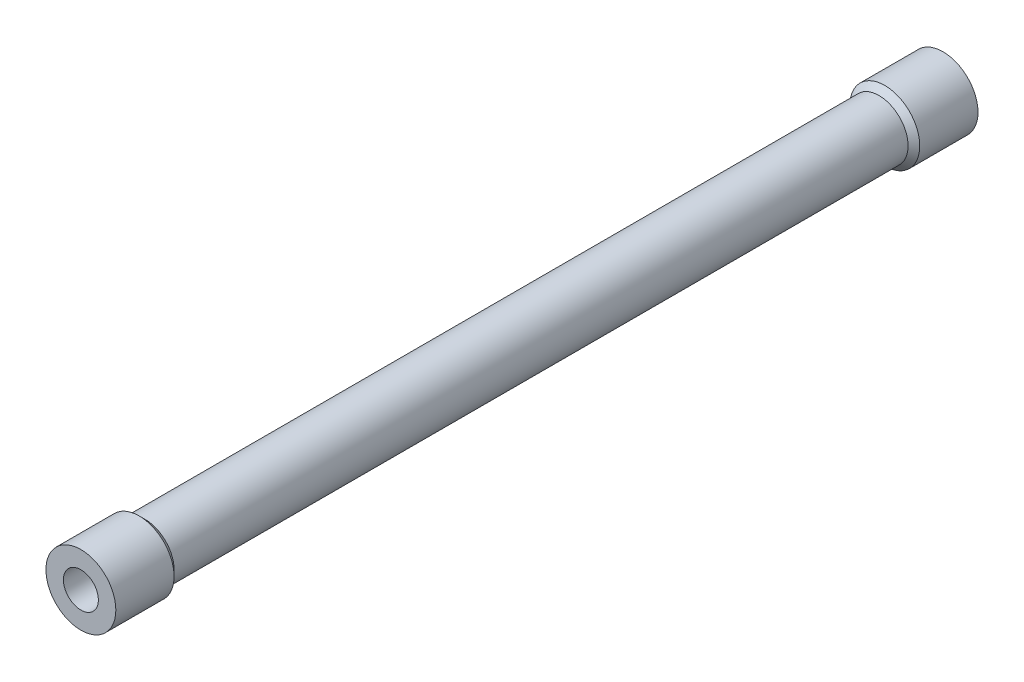
ISO-10303-21;
HEADER;
FILE_DESCRIPTION(('STEP AP214'),'2;1');
FILE_NAME('part.step','',(''),(''),'','','');
FILE_SCHEMA(('AUTOMOTIVE_DESIGN { 1 0 10303 214 1 1 1 1 }'));
ENDSEC;
DATA;
#1=APPLICATION_CONTEXT('core data for automotive mechanical design processes');
#2=APPLICATION_PROTOCOL_DEFINITION('international standard','automotive_design',2000,#1);
#3=PRODUCT_CONTEXT('',#1,'mechanical');
#4=PRODUCT('Part','Part','',(#3));
#5=PRODUCT_RELATED_PRODUCT_CATEGORY('part','',(#4));
#6=PRODUCT_DEFINITION_FORMATION('','',#4);
#7=PRODUCT_DEFINITION_CONTEXT('part definition',#1,'design');
#8=PRODUCT_DEFINITION('design','',#6,#7);
#9=PRODUCT_DEFINITION_SHAPE('','',#8);
#10=(LENGTH_UNIT() NAMED_UNIT(*) SI_UNIT(.MILLI.,.METRE.));
#11=(NAMED_UNIT(*) PLANE_ANGLE_UNIT() SI_UNIT($,.RADIAN.));
#12=(NAMED_UNIT(*) SI_UNIT($,.STERADIAN.) SOLID_ANGLE_UNIT());
#13=UNCERTAINTY_MEASURE_WITH_UNIT(LENGTH_MEASURE(1.E-05),#10,'distance_accuracy_value','');
#14=(GEOMETRIC_REPRESENTATION_CONTEXT(3) GLOBAL_UNCERTAINTY_ASSIGNED_CONTEXT((#13)) GLOBAL_UNIT_ASSIGNED_CONTEXT((#10,
#11,#12)) REPRESENTATION_CONTEXT('',''));
#15=CARTESIAN_POINT('',(0.,0.,0.));
#16=DIRECTION('',(0.,0.,1.));
#17=DIRECTION('',(1.,0.,0.));
#18=AXIS2_PLACEMENT_3D('',#15,#16,#17);
#19=CARTESIAN_POINT('',(0.,0.,74.));
#20=DIRECTION('',(0.,0.,-1.));
#21=DIRECTION('',(-1.,0.,0.));
#22=AXIS2_PLACEMENT_3D('',#19,#20,#21);
#23=CYLINDRICAL_SURFACE('',#22,2.5);
#24=CARTESIAN_POINT('',(0.,0.,5.49999999999999));
#25=DIRECTION('',(0.,0.,-1.));
#26=DIRECTION('',(-1.,0.,0.));
#27=AXIS2_PLACEMENT_3D('',#24,#25,#26);
#28=CIRCLE('',#27,2.5);
#29=CARTESIAN_POINT('',(-2.5,0.,5.49999999999999));
#30=VERTEX_POINT('',#29);
#31=EDGE_CURVE('E10',#30,#30,#28,.F.);
#32=ORIENTED_EDGE('',*,*,#31,.T.);
#33=EDGE_LOOP('',(#32));
#34=FACE_BOUND('',#33,.T.);
#35=CARTESIAN_POINT('',(0.,0.,68.5));
#36=DIRECTION('',(0.,0.,1.));
#37=DIRECTION('',(1.,0.,0.));
#38=AXIS2_PLACEMENT_3D('',#35,#36,#37);
#39=CIRCLE('',#38,2.5);
#40=CARTESIAN_POINT('',(2.5,0.,68.5));
#41=VERTEX_POINT('',#40);
#42=EDGE_CURVE('E41',#41,#41,#39,.F.);
#43=ORIENTED_EDGE('',*,*,#42,.T.);
#44=EDGE_LOOP('',(#43));
#45=FACE_BOUND('',#44,.T.);
#46=ADVANCED_FACE('F30',(#34,#45),#23,.T.);
#47=CARTESIAN_POINT('',(0.,0.,74.));
#48=DIRECTION('',(0.,0.,1.));
#49=DIRECTION('',(1.,0.,0.));
#50=AXIS2_PLACEMENT_3D('',#47,#48,#49);
#51=PLANE('',#50);
#52=CARTESIAN_POINT('',(0.,0.,74.));
#53=DIRECTION('',(0.,0.,1.));
#54=DIRECTION('',(1.,0.,0.));
#55=AXIS2_PLACEMENT_3D('',#52,#53,#54);
#56=CIRCLE('',#55,1.5);
#57=CARTESIAN_POINT('',(1.5,0.,74.));
#58=VERTEX_POINT('',#57);
#59=EDGE_CURVE('E50',#58,#58,#56,.T.);
#60=ORIENTED_EDGE('',*,*,#59,.F.);
#61=EDGE_LOOP('',(#60));
#62=FACE_BOUND('',#61,.T.);
#63=CARTESIAN_POINT('',(0.,0.,74.));
#64=DIRECTION('',(0.,0.,1.));
#65=DIRECTION('',(1.,0.,0.));
#66=AXIS2_PLACEMENT_3D('',#63,#64,#65);
#67=CIRCLE('',#66,3.);
#68=CARTESIAN_POINT('',(3.,0.,74.));
#69=VERTEX_POINT('',#68);
#70=EDGE_CURVE('E54',#69,#69,#67,.T.);
#71=ORIENTED_EDGE('',*,*,#70,.T.);
#72=EDGE_LOOP('',(#71));
#73=FACE_BOUND('',#72,.T.);
#74=ADVANCED_FACE('F68',(#62,#73),#51,.T.);
#75=CARTESIAN_POINT('',(0.,0.,0.));
#76=DIRECTION('',(0.,0.,1.));
#77=DIRECTION('',(1.,0.,0.));
#78=AXIS2_PLACEMENT_3D('',#75,#76,#77);
#79=PLANE('',#78);
#80=CARTESIAN_POINT('',(0.,0.,0.));
#81=DIRECTION('',(0.,0.,1.));
#82=DIRECTION('',(1.,0.,0.));
#83=AXIS2_PLACEMENT_3D('',#80,#81,#82);
#84=CIRCLE('',#83,1.5);
#85=CARTESIAN_POINT('',(1.5,0.,0.));
#86=VERTEX_POINT('',#85);
#87=EDGE_CURVE('E51',#86,#86,#84,.T.);
#88=ORIENTED_EDGE('',*,*,#87,.T.);
#89=EDGE_LOOP('',(#88));
#90=FACE_BOUND('',#89,.T.);
#91=CARTESIAN_POINT('',(0.,0.,0.));
#92=DIRECTION('',(0.,0.,1.));
#93=DIRECTION('',(1.,0.,0.));
#94=AXIS2_PLACEMENT_3D('',#91,#92,#93);
#95=CIRCLE('',#94,3.);
#96=CARTESIAN_POINT('',(3.,0.,0.));
#97=VERTEX_POINT('',#96);
#98=EDGE_CURVE('E59',#97,#97,#95,.T.);
#99=ORIENTED_EDGE('',*,*,#98,.F.);
#100=EDGE_LOOP('',(#99));
#101=FACE_BOUND('',#100,.T.);
#102=ADVANCED_FACE('F65',(#90,#101),#79,.F.);
#103=CARTESIAN_POINT('',(0.,0.,74.));
#104=DIRECTION('',(0.,0.,-1.));
#105=DIRECTION('',(-1.,0.,0.));
#106=AXIS2_PLACEMENT_3D('',#103,#104,#105);
#107=CYLINDRICAL_SURFACE('',#106,1.5);
#108=ORIENTED_EDGE('',*,*,#87,.F.);
#109=EDGE_LOOP('',(#108));
#110=FACE_BOUND('',#109,.T.);
#111=ORIENTED_EDGE('',*,*,#59,.T.);
#112=EDGE_LOOP('',(#111));
#113=FACE_BOUND('',#112,.T.);
#114=ADVANCED_FACE('F67',(#110,#113),#107,.F.);
#115=CARTESIAN_POINT('',(0.,0.,68.));
#116=DIRECTION('',(0.,0.,1.));
#117=DIRECTION('',(1.,0.,0.));
#118=AXIS2_PLACEMENT_3D('',#115,#116,#117);
#119=CYLINDRICAL_SURFACE('',#118,3.);
#120=CARTESIAN_POINT('',(0.,0.,69.));
#121=DIRECTION('',(0.,0.,1.));
#122=DIRECTION('',(1.,0.,0.));
#123=AXIS2_PLACEMENT_3D('',#120,#121,#122);
#124=CIRCLE('',#123,3.);
#125=CARTESIAN_POINT('',(3.,0.,69.));
#126=VERTEX_POINT('',#125);
#127=EDGE_CURVE('E45',#126,#126,#124,.T.);
#128=ORIENTED_EDGE('',*,*,#127,.T.);
#129=EDGE_LOOP('',(#128));
#130=FACE_BOUND('',#129,.T.);
#131=ORIENTED_EDGE('',*,*,#70,.F.);
#132=EDGE_LOOP('',(#131));
#133=FACE_BOUND('',#132,.T.);
#134=ADVANCED_FACE('F75',(#130,#133),#119,.T.);
#135=CARTESIAN_POINT('',(0.,0.,69.));
#136=DIRECTION('',(0.,0.,1.));
#137=DIRECTION('',(1.,0.,0.));
#138=AXIS2_PLACEMENT_3D('',#135,#136,#137);
#139=CONICAL_SURFACE('',#138,3.,0.785398163397445);
#140=ORIENTED_EDGE('',*,*,#42,.F.);
#141=EDGE_LOOP('',(#140));
#142=FACE_BOUND('',#141,.T.);
#143=ORIENTED_EDGE('',*,*,#127,.F.);
#144=EDGE_LOOP('',(#143));
#145=FACE_BOUND('',#144,.T.);
#146=ADVANCED_FACE('F85',(#142,#145),#139,.T.);
#147=CARTESIAN_POINT('',(0.,0.,6.));
#148=DIRECTION('',(0.,0.,-1.));
#149=DIRECTION('',(-1.,0.,0.));
#150=AXIS2_PLACEMENT_3D('',#147,#148,#149);
#151=CYLINDRICAL_SURFACE('',#150,3.);
#152=CARTESIAN_POINT('',(0.,0.,4.99999999999999));
#153=DIRECTION('',(0.,0.,-1.));
#154=DIRECTION('',(-1.,0.,0.));
#155=AXIS2_PLACEMENT_3D('',#152,#153,#154);
#156=CIRCLE('',#155,3.);
#157=CARTESIAN_POINT('',(-3.,0.,4.99999999999999));
#158=VERTEX_POINT('',#157);
#159=EDGE_CURVE('E37',#158,#158,#156,.T.);
#160=ORIENTED_EDGE('',*,*,#159,.T.);
#161=EDGE_LOOP('',(#160));
#162=FACE_BOUND('',#161,.T.);
#163=ORIENTED_EDGE('',*,*,#98,.T.);
#164=EDGE_LOOP('',(#163));
#165=FACE_BOUND('',#164,.T.);
#166=ADVANCED_FACE('F63',(#162,#165),#151,.T.);
#167=CARTESIAN_POINT('',(0.,0.,6.));
#168=DIRECTION('',(0.,0.,-1.));
#169=DIRECTION('',(-1.,0.,0.));
#170=AXIS2_PLACEMENT_3D('',#167,#168,#169);
#171=CONICAL_SURFACE('',#170,1.99999999999998,0.785398163397454);
#172=ORIENTED_EDGE('',*,*,#159,.F.);
#173=EDGE_LOOP('',(#172));
#174=FACE_BOUND('',#173,.T.);
#175=ORIENTED_EDGE('',*,*,#31,.F.);
#176=EDGE_LOOP('',(#175));
#177=FACE_BOUND('',#176,.T.);
#178=ADVANCED_FACE('F32',(#174,#177),#171,.T.);
#179=CLOSED_SHELL('',(#46,#74,#102,#114,#134,#146,#166,#178));
#180=MANIFOLD_SOLID_BREP('B2',#179);
#181=ADVANCED_BREP_SHAPE_REPRESENTATION('',(#18,#180),#14);
#182=SHAPE_DEFINITION_REPRESENTATION(#9,#181);
ENDSEC;
END-ISO-10303-21;
